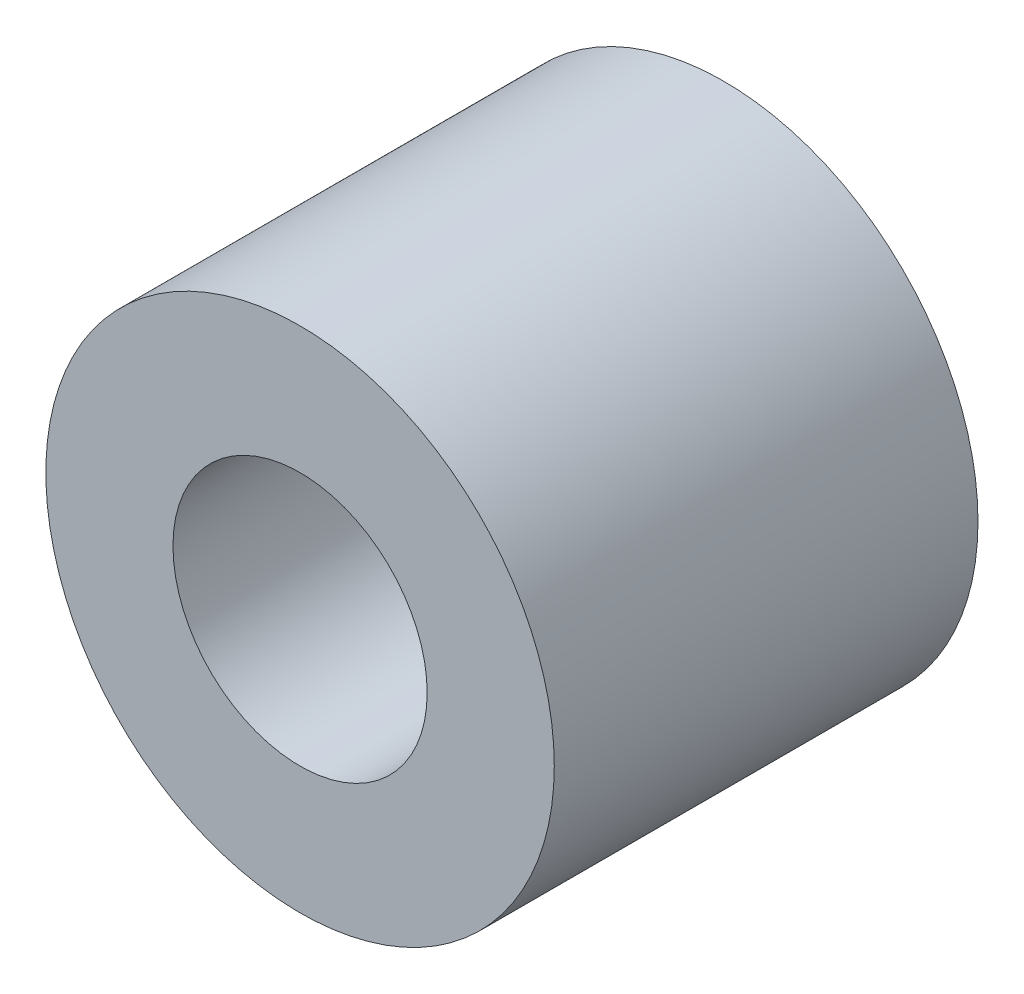
ISO-10303-21;
HEADER;
FILE_DESCRIPTION(('STEP AP214'),'2;1');
FILE_NAME('part.step','',(''),(''),'','','');
FILE_SCHEMA(('AUTOMOTIVE_DESIGN { 1 0 10303 214 1 1 1 1 }'));
ENDSEC;
DATA;
#1=APPLICATION_CONTEXT('core data for automotive mechanical design processes');
#2=APPLICATION_PROTOCOL_DEFINITION('international standard','automotive_design',2000,#1);
#3=PRODUCT_CONTEXT('',#1,'mechanical');
#4=PRODUCT('Part','Part','',(#3));
#5=PRODUCT_RELATED_PRODUCT_CATEGORY('part','',(#4));
#6=PRODUCT_DEFINITION_FORMATION('','',#4);
#7=PRODUCT_DEFINITION_CONTEXT('part definition',#1,'design');
#8=PRODUCT_DEFINITION('design','',#6,#7);
#9=PRODUCT_DEFINITION_SHAPE('','',#8);
#10=(LENGTH_UNIT() NAMED_UNIT(*) SI_UNIT(.MILLI.,.METRE.));
#11=(NAMED_UNIT(*) PLANE_ANGLE_UNIT() SI_UNIT($,.RADIAN.));
#12=(NAMED_UNIT(*) SI_UNIT($,.STERADIAN.) SOLID_ANGLE_UNIT());
#13=UNCERTAINTY_MEASURE_WITH_UNIT(LENGTH_MEASURE(1.E-05),#10,'distance_accuracy_value','');
#14=(GEOMETRIC_REPRESENTATION_CONTEXT(3) GLOBAL_UNCERTAINTY_ASSIGNED_CONTEXT((#13)) GLOBAL_UNIT_ASSIGNED_CONTEXT((#10,
#11,#12)) REPRESENTATION_CONTEXT('',''));
#15=CARTESIAN_POINT('',(0.,0.,0.));
#16=DIRECTION('',(0.,0.,1.));
#17=DIRECTION('',(1.,0.,0.));
#18=AXIS2_PLACEMENT_3D('',#15,#16,#17);
#19=CARTESIAN_POINT('',(0.,0.,5.));
#20=DIRECTION('',(0.,0.,1.));
#21=DIRECTION('',(1.,0.,0.));
#22=AXIS2_PLACEMENT_3D('',#19,#20,#21);
#23=PLANE('',#22);
#24=CARTESIAN_POINT('',(0.,0.,5.));
#25=DIRECTION('',(0.,0.,1.));
#26=DIRECTION('',(1.,0.,0.));
#27=AXIS2_PLACEMENT_3D('',#24,#25,#26);
#28=CIRCLE('',#27,3.);
#29=CARTESIAN_POINT('',(3.,0.,5.));
#30=VERTEX_POINT('',#29);
#31=EDGE_CURVE('E10',#30,#30,#28,.T.);
#32=ORIENTED_EDGE('',*,*,#31,.T.);
#33=EDGE_LOOP('',(#32));
#34=FACE_BOUND('',#33,.T.);
#35=CARTESIAN_POINT('',(0.,0.,5.));
#36=DIRECTION('',(0.,0.,1.));
#37=DIRECTION('',(1.,0.,0.));
#38=AXIS2_PLACEMENT_3D('',#35,#36,#37);
#39=CIRCLE('',#38,1.5);
#40=CARTESIAN_POINT('',(1.5,0.,5.));
#41=VERTEX_POINT('',#40);
#42=EDGE_CURVE('E42',#41,#41,#39,.T.);
#43=ORIENTED_EDGE('',*,*,#42,.F.);
#44=EDGE_LOOP('',(#43));
#45=FACE_BOUND('',#44,.T.);
#46=ADVANCED_FACE('F31',(#34,#45),#23,.T.);
#47=CARTESIAN_POINT('',(0.,0.,0.));
#48=DIRECTION('',(0.,0.,1.));
#49=DIRECTION('',(1.,0.,0.));
#50=AXIS2_PLACEMENT_3D('',#47,#48,#49);
#51=PLANE('',#50);
#52=CARTESIAN_POINT('',(0.,0.,0.));
#53=DIRECTION('',(0.,0.,1.));
#54=DIRECTION('',(1.,0.,0.));
#55=AXIS2_PLACEMENT_3D('',#52,#53,#54);
#56=CIRCLE('',#55,3.);
#57=CARTESIAN_POINT('',(3.,0.,0.));
#58=VERTEX_POINT('',#57);
#59=EDGE_CURVE('E35',#58,#58,#56,.T.);
#60=ORIENTED_EDGE('',*,*,#59,.F.);
#61=EDGE_LOOP('',(#60));
#62=FACE_BOUND('',#61,.T.);
#63=CARTESIAN_POINT('',(0.,0.,0.));
#64=DIRECTION('',(0.,0.,1.));
#65=DIRECTION('',(1.,0.,0.));
#66=AXIS2_PLACEMENT_3D('',#63,#64,#65);
#67=CIRCLE('',#66,1.5);
#68=CARTESIAN_POINT('',(1.5,0.,0.));
#69=VERTEX_POINT('',#68);
#70=EDGE_CURVE('E44',#69,#69,#67,.T.);
#71=ORIENTED_EDGE('',*,*,#70,.T.);
#72=EDGE_LOOP('',(#71));
#73=FACE_BOUND('',#72,.T.);
#74=ADVANCED_FACE('F54',(#62,#73),#51,.F.);
#75=CARTESIAN_POINT('',(0.,0.,5.));
#76=DIRECTION('',(0.,0.,-1.));
#77=DIRECTION('',(-1.,0.,0.));
#78=AXIS2_PLACEMENT_3D('',#75,#76,#77);
#79=CYLINDRICAL_SURFACE('',#78,3.);
#80=ORIENTED_EDGE('',*,*,#31,.F.);
#81=EDGE_LOOP('',(#80));
#82=FACE_BOUND('',#81,.T.);
#83=ORIENTED_EDGE('',*,*,#59,.T.);
#84=EDGE_LOOP('',(#83));
#85=FACE_BOUND('',#84,.T.);
#86=ADVANCED_FACE('F33',(#82,#85),#79,.T.);
#87=CARTESIAN_POINT('',(0.,0.,5.));
#88=DIRECTION('',(0.,0.,-1.));
#89=DIRECTION('',(-1.,0.,0.));
#90=AXIS2_PLACEMENT_3D('',#87,#88,#89);
#91=CYLINDRICAL_SURFACE('',#90,1.5);
#92=ORIENTED_EDGE('',*,*,#42,.T.);
#93=EDGE_LOOP('',(#92));
#94=FACE_BOUND('',#93,.T.);
#95=ORIENTED_EDGE('',*,*,#70,.F.);
#96=EDGE_LOOP('',(#95));
#97=FACE_BOUND('',#96,.T.);
#98=ADVANCED_FACE('F50',(#94,#97),#91,.F.);
#99=CLOSED_SHELL('',(#46,#74,#86,#98));
#100=MANIFOLD_SOLID_BREP('B2',#99);
#101=ADVANCED_BREP_SHAPE_REPRESENTATION('',(#18,#100),#14);
#102=SHAPE_DEFINITION_REPRESENTATION(#9,#101);
ENDSEC;
END-ISO-10303-21;
